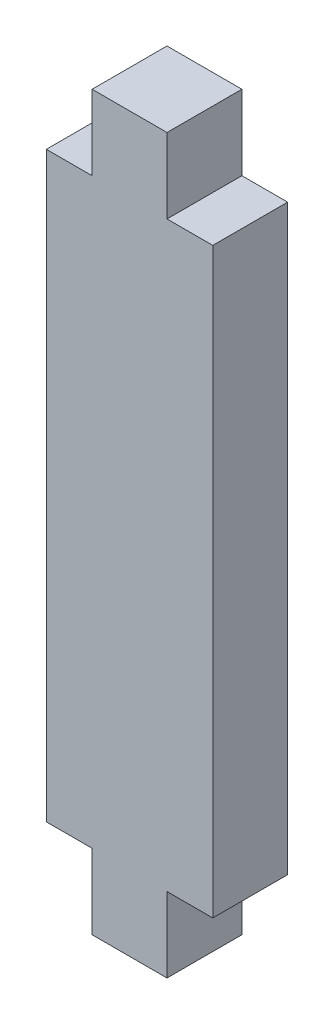
ISO-10303-21;
HEADER;
FILE_DESCRIPTION(('STEP AP214'),'2;1');
FILE_NAME('part.step','',(''),(''),'','','');
FILE_SCHEMA(('AUTOMOTIVE_DESIGN { 1 0 10303 214 1 1 1 1 }'));
ENDSEC;
DATA;
#1=APPLICATION_CONTEXT('core data for automotive mechanical design processes');
#2=APPLICATION_PROTOCOL_DEFINITION('international standard','automotive_design',2000,#1);
#3=PRODUCT_CONTEXT('',#1,'mechanical');
#4=PRODUCT('Part','Part','',(#3));
#5=PRODUCT_RELATED_PRODUCT_CATEGORY('part','',(#4));
#6=PRODUCT_DEFINITION_FORMATION('','',#4);
#7=PRODUCT_DEFINITION_CONTEXT('part definition',#1,'design');
#8=PRODUCT_DEFINITION('design','',#6,#7);
#9=PRODUCT_DEFINITION_SHAPE('','',#8);
#10=(LENGTH_UNIT() NAMED_UNIT(*) SI_UNIT(.MILLI.,.METRE.));
#11=(NAMED_UNIT(*) PLANE_ANGLE_UNIT() SI_UNIT($,.RADIAN.));
#12=(NAMED_UNIT(*) SI_UNIT($,.STERADIAN.) SOLID_ANGLE_UNIT());
#13=UNCERTAINTY_MEASURE_WITH_UNIT(LENGTH_MEASURE(1.E-05),#10,'distance_accuracy_value','');
#14=(GEOMETRIC_REPRESENTATION_CONTEXT(3) GLOBAL_UNCERTAINTY_ASSIGNED_CONTEXT((#13)) GLOBAL_UNIT_ASSIGNED_CONTEXT((#10,
#11,#12)) REPRESENTATION_CONTEXT('',''));
#15=CARTESIAN_POINT('',(0.,0.,0.));
#16=DIRECTION('',(0.,0.,1.));
#17=DIRECTION('',(1.,0.,0.));
#18=AXIS2_PLACEMENT_3D('',#15,#16,#17);
#19=CARTESIAN_POINT('',(2.25,0.,-2.25));
#20=DIRECTION('',(-1.,0.,0.));
#21=DIRECTION('',(0.,0.,1.));
#22=AXIS2_PLACEMENT_3D('',#19,#20,#21);
#23=PLANE('',#22);
#24=DIRECTION('',(0.,-1.,0.));
#25=VECTOR('',#24,1.);
#26=CARTESIAN_POINT('',(2.25,0.,2.25));
#27=LINE('',#26,#25);
#28=CARTESIAN_POINT('',(2.25,22.,2.25));
#29=VERTEX_POINT('',#28);
#30=CARTESIAN_POINT('',(2.25,17.5,2.25));
#31=VERTEX_POINT('',#30);
#32=EDGE_CURVE('E131',#29,#31,#27,.T.);
#33=ORIENTED_EDGE('',*,*,#32,.T.);
#34=DIRECTION('',(0.,0.,1.));
#35=VECTOR('',#34,1.);
#36=CARTESIAN_POINT('',(2.25,17.5,-2.25));
#37=LINE('',#36,#35);
#38=CARTESIAN_POINT('',(2.25,17.5,-2.25));
#39=VERTEX_POINT('',#38);
#40=EDGE_CURVE('E11',#39,#31,#37,.T.);
#41=ORIENTED_EDGE('',*,*,#40,.F.);
#42=DIRECTION('',(0.,-1.,0.));
#43=VECTOR('',#42,1.);
#44=CARTESIAN_POINT('',(2.25,0.,-2.25));
#45=LINE('',#44,#43);
#46=CARTESIAN_POINT('',(2.25,22.,-2.25));
#47=VERTEX_POINT('',#46);
#48=EDGE_CURVE('E157',#47,#39,#45,.T.);
#49=ORIENTED_EDGE('',*,*,#48,.F.);
#50=DIRECTION('',(0.,0.,1.));
#51=VECTOR('',#50,1.);
#52=CARTESIAN_POINT('',(2.25,22.,-2.25));
#53=LINE('',#52,#51);
#54=EDGE_CURVE('E38',#47,#29,#53,.T.);
#55=ORIENTED_EDGE('',*,*,#54,.T.);
#56=EDGE_LOOP('',(#33,#41,#49,#55));
#57=FACE_BOUND('',#56,.T.);
#58=ADVANCED_FACE('F35',(#57),#23,.F.);
#59=CARTESIAN_POINT('',(0.,17.5,-2.25));
#60=DIRECTION('',(0.,-1.,0.));
#61=DIRECTION('',(0.,0.,-1.));
#62=AXIS2_PLACEMENT_3D('',#59,#60,#61);
#63=PLANE('',#62);
#64=DIRECTION('',(1.,0.,0.));
#65=VECTOR('',#64,1.);
#66=CARTESIAN_POINT('',(0.,17.5,2.25));
#67=LINE('',#66,#65);
#68=CARTESIAN_POINT('',(5.,17.5,2.25));
#69=VERTEX_POINT('',#68);
#70=EDGE_CURVE('E73',#31,#69,#67,.T.);
#71=ORIENTED_EDGE('',*,*,#70,.T.);
#72=DIRECTION('',(0.,0.,1.));
#73=VECTOR('',#72,1.);
#74=CARTESIAN_POINT('',(5.,17.5,-2.25));
#75=LINE('',#74,#73);
#76=CARTESIAN_POINT('',(5.,17.5,-2.25));
#77=VERTEX_POINT('',#76);
#78=EDGE_CURVE('E44',#77,#69,#75,.T.);
#79=ORIENTED_EDGE('',*,*,#78,.F.);
#80=DIRECTION('',(1.,0.,0.));
#81=VECTOR('',#80,1.);
#82=CARTESIAN_POINT('',(0.,17.5,-2.25));
#83=LINE('',#82,#81);
#84=EDGE_CURVE('E52',#39,#77,#83,.T.);
#85=ORIENTED_EDGE('',*,*,#84,.F.);
#86=ORIENTED_EDGE('',*,*,#40,.T.);
#87=EDGE_LOOP('',(#71,#79,#85,#86));
#88=FACE_BOUND('',#87,.T.);
#89=ADVANCED_FACE('F159',(#88),#63,.F.);
#90=CARTESIAN_POINT('',(5.,0.,-2.25));
#91=DIRECTION('',(-1.,0.,0.));
#92=DIRECTION('',(0.,-1.,0.));
#93=AXIS2_PLACEMENT_3D('',#90,#91,#92);
#94=PLANE('',#93);
#95=DIRECTION('',(0.,-1.,0.));
#96=VECTOR('',#95,1.);
#97=CARTESIAN_POINT('',(5.,0.,2.25));
#98=LINE('',#97,#96);
#99=CARTESIAN_POINT('',(5.,-17.5,2.25));
#100=VERTEX_POINT('',#99);
#101=EDGE_CURVE('E143',#69,#100,#98,.T.);
#102=ORIENTED_EDGE('',*,*,#101,.T.);
#103=DIRECTION('',(0.,0.,1.));
#104=VECTOR('',#103,1.);
#105=CARTESIAN_POINT('',(5.,-17.5,-2.25));
#106=LINE('',#105,#104);
#107=CARTESIAN_POINT('',(5.,-17.5,-2.25));
#108=VERTEX_POINT('',#107);
#109=EDGE_CURVE('E163',#108,#100,#106,.T.);
#110=ORIENTED_EDGE('',*,*,#109,.F.);
#111=DIRECTION('',(0.,-1.,0.));
#112=VECTOR('',#111,1.);
#113=CARTESIAN_POINT('',(5.,0.,-2.25));
#114=LINE('',#113,#112);
#115=EDGE_CURVE('E125',#77,#108,#114,.T.);
#116=ORIENTED_EDGE('',*,*,#115,.F.);
#117=ORIENTED_EDGE('',*,*,#78,.T.);
#118=EDGE_LOOP('',(#102,#110,#116,#117));
#119=FACE_BOUND('',#118,.T.);
#120=ADVANCED_FACE('F161',(#119),#94,.F.);
#121=CARTESIAN_POINT('',(-5.,0.,-2.25));
#122=DIRECTION('',(-1.,0.,0.));
#123=DIRECTION('',(0.,-1.,0.));
#124=AXIS2_PLACEMENT_3D('',#121,#122,#123);
#125=PLANE('',#124);
#126=DIRECTION('',(0.,-1.,0.));
#127=VECTOR('',#126,1.);
#128=CARTESIAN_POINT('',(-5.,0.,2.25));
#129=LINE('',#128,#127);
#130=CARTESIAN_POINT('',(-5.,17.5,2.25));
#131=VERTEX_POINT('',#130);
#132=CARTESIAN_POINT('',(-5.,-17.5,2.25));
#133=VERTEX_POINT('',#132);
#134=EDGE_CURVE('E108',#131,#133,#129,.T.);
#135=ORIENTED_EDGE('',*,*,#134,.F.);
#136=DIRECTION('',(0.,0.,1.));
#137=VECTOR('',#136,1.);
#138=CARTESIAN_POINT('',(-5.,17.5,-2.25));
#139=LINE('',#138,#137);
#140=CARTESIAN_POINT('',(-5.,17.5,-2.25));
#141=VERTEX_POINT('',#140);
#142=EDGE_CURVE('E99',#141,#131,#139,.T.);
#143=ORIENTED_EDGE('',*,*,#142,.F.);
#144=DIRECTION('',(0.,-1.,0.));
#145=VECTOR('',#144,1.);
#146=CARTESIAN_POINT('',(-5.,0.,-2.25));
#147=LINE('',#146,#145);
#148=CARTESIAN_POINT('',(-5.,-17.5,-2.25));
#149=VERTEX_POINT('',#148);
#150=EDGE_CURVE('E105',#141,#149,#147,.T.);
#151=ORIENTED_EDGE('',*,*,#150,.T.);
#152=DIRECTION('',(0.,0.,1.));
#153=VECTOR('',#152,1.);
#154=CARTESIAN_POINT('',(-5.,-17.5,-2.25));
#155=LINE('',#154,#153);
#156=EDGE_CURVE('E170',#149,#133,#155,.T.);
#157=ORIENTED_EDGE('',*,*,#156,.T.);
#158=EDGE_LOOP('',(#135,#143,#151,#157));
#159=FACE_BOUND('',#158,.T.);
#160=ADVANCED_FACE('F101',(#159),#125,.T.);
#161=CARTESIAN_POINT('',(-2.25,17.5,2.25));
#162=VERTEX_POINT('',#161);
#163=EDGE_CURVE('E140',#131,#162,#67,.T.);
#164=ORIENTED_EDGE('',*,*,#163,.T.);
#165=DIRECTION('',(0.,0.,1.));
#166=VECTOR('',#165,1.);
#167=CARTESIAN_POINT('',(-2.25,17.5,-2.25));
#168=LINE('',#167,#166);
#169=CARTESIAN_POINT('',(-2.25,17.5,-2.25));
#170=VERTEX_POINT('',#169);
#171=EDGE_CURVE('E112',#170,#162,#168,.T.);
#172=ORIENTED_EDGE('',*,*,#171,.F.);
#173=EDGE_CURVE('E115',#141,#170,#83,.T.);
#174=ORIENTED_EDGE('',*,*,#173,.F.);
#175=ORIENTED_EDGE('',*,*,#142,.T.);
#176=EDGE_LOOP('',(#164,#172,#174,#175));
#177=FACE_BOUND('',#176,.T.);
#178=ADVANCED_FACE('F116',(#177),#63,.F.);
#179=CARTESIAN_POINT('',(-2.25,0.,-2.25));
#180=DIRECTION('',(-1.,0.,0.));
#181=DIRECTION('',(0.,-1.,0.));
#182=AXIS2_PLACEMENT_3D('',#179,#180,#181);
#183=PLANE('',#182);
#184=DIRECTION('',(0.,-1.,0.));
#185=VECTOR('',#184,1.);
#186=CARTESIAN_POINT('',(-2.25,0.,2.25));
#187=LINE('',#186,#185);
#188=CARTESIAN_POINT('',(-2.25,22.,2.25));
#189=VERTEX_POINT('',#188);
#190=EDGE_CURVE('E137',#189,#162,#187,.T.);
#191=ORIENTED_EDGE('',*,*,#190,.F.);
#192=DIRECTION('',(0.,0.,1.));
#193=VECTOR('',#192,1.);
#194=CARTESIAN_POINT('',(-2.25,22.,-2.25));
#195=LINE('',#194,#193);
#196=CARTESIAN_POINT('',(-2.25,22.,-2.25));
#197=VERTEX_POINT('',#196);
#198=EDGE_CURVE('E147',#197,#189,#195,.T.);
#199=ORIENTED_EDGE('',*,*,#198,.F.);
#200=DIRECTION('',(0.,-1.,0.));
#201=VECTOR('',#200,1.);
#202=CARTESIAN_POINT('',(-2.25,0.,-2.25));
#203=LINE('',#202,#201);
#204=EDGE_CURVE('E118',#197,#170,#203,.T.);
#205=ORIENTED_EDGE('',*,*,#204,.T.);
#206=ORIENTED_EDGE('',*,*,#171,.T.);
#207=EDGE_LOOP('',(#191,#199,#205,#206));
#208=FACE_BOUND('',#207,.T.);
#209=ADVANCED_FACE('F210',(#208),#183,.T.);
#210=CARTESIAN_POINT('',(0.,22.,-2.25));
#211=DIRECTION('',(0.,-1.,0.));
#212=DIRECTION('',(0.,0.,-1.));
#213=AXIS2_PLACEMENT_3D('',#210,#211,#212);
#214=PLANE('',#213);
#215=DIRECTION('',(1.,0.,0.));
#216=VECTOR('',#215,1.);
#217=CARTESIAN_POINT('',(0.,22.,2.25));
#218=LINE('',#217,#216);
#219=EDGE_CURVE('E134',#189,#29,#218,.T.);
#220=ORIENTED_EDGE('',*,*,#219,.T.);
#221=ORIENTED_EDGE('',*,*,#54,.F.);
#222=DIRECTION('',(1.,0.,0.));
#223=VECTOR('',#222,1.);
#224=CARTESIAN_POINT('',(0.,22.,-2.25));
#225=LINE('',#224,#223);
#226=EDGE_CURVE('E85',#197,#47,#225,.T.);
#227=ORIENTED_EDGE('',*,*,#226,.F.);
#228=ORIENTED_EDGE('',*,*,#198,.T.);
#229=EDGE_LOOP('',(#220,#221,#227,#228));
#230=FACE_BOUND('',#229,.T.);
#231=ADVANCED_FACE('F211',(#230),#214,.F.);
#232=CARTESIAN_POINT('',(0.,0.,-2.25));
#233=DIRECTION('',(0.,0.,1.));
#234=DIRECTION('',(1.,0.,0.));
#235=AXIS2_PLACEMENT_3D('',#232,#233,#234);
#236=PLANE('',#235);
#237=ORIENTED_EDGE('',*,*,#48,.T.);
#238=ORIENTED_EDGE('',*,*,#84,.T.);
#239=ORIENTED_EDGE('',*,*,#115,.T.);
#240=DIRECTION('',(1.,0.,0.));
#241=VECTOR('',#240,1.);
#242=CARTESIAN_POINT('',(0.,-17.5,-2.25));
#243=LINE('',#242,#241);
#244=CARTESIAN_POINT('',(2.25,-17.5,-2.25));
#245=VERTEX_POINT('',#244);
#246=EDGE_CURVE('E173',#245,#108,#243,.T.);
#247=ORIENTED_EDGE('',*,*,#246,.F.);
#248=DIRECTION('',(0.,1.,0.));
#249=VECTOR('',#248,1.);
#250=CARTESIAN_POINT('',(2.25,0.,-2.25));
#251=LINE('',#250,#249);
#252=CARTESIAN_POINT('',(2.25,-22.,-2.25));
#253=VERTEX_POINT('',#252);
#254=EDGE_CURVE('E246',#253,#245,#251,.T.);
#255=ORIENTED_EDGE('',*,*,#254,.F.);
#256=DIRECTION('',(1.,0.,0.));
#257=VECTOR('',#256,1.);
#258=CARTESIAN_POINT('',(0.,-22.,-2.25));
#259=LINE('',#258,#257);
#260=CARTESIAN_POINT('',(-2.25,-22.,-2.25));
#261=VERTEX_POINT('',#260);
#262=EDGE_CURVE('E242',#261,#253,#259,.T.);
#263=ORIENTED_EDGE('',*,*,#262,.F.);
#264=DIRECTION('',(0.,1.,0.));
#265=VECTOR('',#264,1.);
#266=CARTESIAN_POINT('',(-2.25,0.,-2.25));
#267=LINE('',#266,#265);
#268=CARTESIAN_POINT('',(-2.25,-17.5,-2.25));
#269=VERTEX_POINT('',#268);
#270=EDGE_CURVE('E183',#261,#269,#267,.T.);
#271=ORIENTED_EDGE('',*,*,#270,.T.);
#272=EDGE_CURVE('E123',#149,#269,#243,.T.);
#273=ORIENTED_EDGE('',*,*,#272,.F.);
#274=ORIENTED_EDGE('',*,*,#150,.F.);
#275=ORIENTED_EDGE('',*,*,#173,.T.);
#276=ORIENTED_EDGE('',*,*,#204,.F.);
#277=ORIENTED_EDGE('',*,*,#226,.T.);
#278=EDGE_LOOP('',(#237,#238,#239,#247,#255,#263,#271,#273,#274,#275,#276,#277));
#279=FACE_BOUND('',#278,.T.);
#280=ADVANCED_FACE('F120',(#279),#236,.F.);
#281=CARTESIAN_POINT('',(0.,0.,2.25));
#282=DIRECTION('',(0.,0.,1.));
#283=DIRECTION('',(1.,0.,0.));
#284=AXIS2_PLACEMENT_3D('',#281,#282,#283);
#285=PLANE('',#284);
#286=ORIENTED_EDGE('',*,*,#32,.F.);
#287=ORIENTED_EDGE('',*,*,#219,.F.);
#288=ORIENTED_EDGE('',*,*,#190,.T.);
#289=ORIENTED_EDGE('',*,*,#163,.F.);
#290=ORIENTED_EDGE('',*,*,#134,.T.);
#291=DIRECTION('',(1.,0.,0.));
#292=VECTOR('',#291,1.);
#293=CARTESIAN_POINT('',(0.,-17.5,2.25));
#294=LINE('',#293,#292);
#295=CARTESIAN_POINT('',(-2.25,-17.5,2.25));
#296=VERTEX_POINT('',#295);
#297=EDGE_CURVE('E196',#133,#296,#294,.T.);
#298=ORIENTED_EDGE('',*,*,#297,.T.);
#299=DIRECTION('',(0.,1.,0.));
#300=VECTOR('',#299,1.);
#301=CARTESIAN_POINT('',(-2.25,0.,2.25));
#302=LINE('',#301,#300);
#303=CARTESIAN_POINT('',(-2.25,-22.,2.25));
#304=VERTEX_POINT('',#303);
#305=EDGE_CURVE('E193',#304,#296,#302,.T.);
#306=ORIENTED_EDGE('',*,*,#305,.F.);
#307=DIRECTION('',(1.,0.,0.));
#308=VECTOR('',#307,1.);
#309=CARTESIAN_POINT('',(0.,-22.,2.25));
#310=LINE('',#309,#308);
#311=CARTESIAN_POINT('',(2.25,-22.,2.25));
#312=VERTEX_POINT('',#311);
#313=EDGE_CURVE('E190',#304,#312,#310,.T.);
#314=ORIENTED_EDGE('',*,*,#313,.T.);
#315=DIRECTION('',(0.,1.,0.));
#316=VECTOR('',#315,1.);
#317=CARTESIAN_POINT('',(2.25,0.,2.25));
#318=LINE('',#317,#316);
#319=CARTESIAN_POINT('',(2.25,-17.5,2.25));
#320=VERTEX_POINT('',#319);
#321=EDGE_CURVE('E187',#312,#320,#318,.T.);
#322=ORIENTED_EDGE('',*,*,#321,.T.);
#323=EDGE_CURVE('E199',#320,#100,#294,.T.);
#324=ORIENTED_EDGE('',*,*,#323,.T.);
#325=ORIENTED_EDGE('',*,*,#101,.F.);
#326=ORIENTED_EDGE('',*,*,#70,.F.);
#327=EDGE_LOOP('',(#286,#287,#288,#289,#290,#298,#306,#314,#322,#324,#325,#326));
#328=FACE_BOUND('',#327,.T.);
#329=ADVANCED_FACE('F212',(#328),#285,.T.);
#330=CARTESIAN_POINT('',(2.25,0.,-2.25));
#331=DIRECTION('',(-1.,0.,0.));
#332=DIRECTION('',(0.,0.,1.));
#333=AXIS2_PLACEMENT_3D('',#330,#331,#332);
#334=PLANE('',#333);
#335=ORIENTED_EDGE('',*,*,#321,.F.);
#336=DIRECTION('',(0.,0.,1.));
#337=VECTOR('',#336,1.);
#338=CARTESIAN_POINT('',(2.25,-22.,-2.25));
#339=LINE('',#338,#337);
#340=EDGE_CURVE('E178',#253,#312,#339,.T.);
#341=ORIENTED_EDGE('',*,*,#340,.F.);
#342=ORIENTED_EDGE('',*,*,#254,.T.);
#343=DIRECTION('',(0.,0.,1.));
#344=VECTOR('',#343,1.);
#345=CARTESIAN_POINT('',(2.25,-17.5,-2.25));
#346=LINE('',#345,#344);
#347=EDGE_CURVE('E135',#245,#320,#346,.T.);
#348=ORIENTED_EDGE('',*,*,#347,.T.);
#349=EDGE_LOOP('',(#335,#341,#342,#348));
#350=FACE_BOUND('',#349,.T.);
#351=ADVANCED_FACE('F249',(#350),#334,.F.);
#352=CARTESIAN_POINT('',(0.,-17.5,-2.25));
#353=DIRECTION('',(0.,1.,0.));
#354=DIRECTION('',(0.,0.,-1.));
#355=AXIS2_PLACEMENT_3D('',#352,#353,#354);
#356=PLANE('',#355);
#357=ORIENTED_EDGE('',*,*,#323,.F.);
#358=ORIENTED_EDGE('',*,*,#347,.F.);
#359=ORIENTED_EDGE('',*,*,#246,.T.);
#360=ORIENTED_EDGE('',*,*,#109,.T.);
#361=EDGE_LOOP('',(#357,#358,#359,#360));
#362=FACE_BOUND('',#361,.T.);
#363=ADVANCED_FACE('F174',(#362),#356,.F.);
#364=ORIENTED_EDGE('',*,*,#297,.F.);
#365=ORIENTED_EDGE('',*,*,#156,.F.);
#366=ORIENTED_EDGE('',*,*,#272,.T.);
#367=DIRECTION('',(0.,0.,1.));
#368=VECTOR('',#367,1.);
#369=CARTESIAN_POINT('',(-2.25,-17.5,-2.25));
#370=LINE('',#369,#368);
#371=EDGE_CURVE('E202',#269,#296,#370,.T.);
#372=ORIENTED_EDGE('',*,*,#371,.T.);
#373=EDGE_LOOP('',(#364,#365,#366,#372));
#374=FACE_BOUND('',#373,.T.);
#375=ADVANCED_FACE('F219',(#374),#356,.F.);
#376=CARTESIAN_POINT('',(-2.25,0.,-2.25));
#377=DIRECTION('',(-1.,0.,0.));
#378=DIRECTION('',(0.,1.,0.));
#379=AXIS2_PLACEMENT_3D('',#376,#377,#378);
#380=PLANE('',#379);
#381=ORIENTED_EDGE('',*,*,#305,.T.);
#382=ORIENTED_EDGE('',*,*,#371,.F.);
#383=ORIENTED_EDGE('',*,*,#270,.F.);
#384=DIRECTION('',(0.,0.,1.));
#385=VECTOR('',#384,1.);
#386=CARTESIAN_POINT('',(-2.25,-22.,-2.25));
#387=LINE('',#386,#385);
#388=EDGE_CURVE('E181',#261,#304,#387,.T.);
#389=ORIENTED_EDGE('',*,*,#388,.T.);
#390=EDGE_LOOP('',(#381,#382,#383,#389));
#391=FACE_BOUND('',#390,.T.);
#392=ADVANCED_FACE('F226',(#391),#380,.T.);
#393=CARTESIAN_POINT('',(0.,-22.,-2.25));
#394=DIRECTION('',(0.,1.,0.));
#395=DIRECTION('',(0.,0.,-1.));
#396=AXIS2_PLACEMENT_3D('',#393,#394,#395);
#397=PLANE('',#396);
#398=ORIENTED_EDGE('',*,*,#313,.F.);
#399=ORIENTED_EDGE('',*,*,#388,.F.);
#400=ORIENTED_EDGE('',*,*,#262,.T.);
#401=ORIENTED_EDGE('',*,*,#340,.T.);
#402=EDGE_LOOP('',(#398,#399,#400,#401));
#403=FACE_BOUND('',#402,.T.);
#404=ADVANCED_FACE('F243',(#403),#397,.F.);
#405=CLOSED_SHELL('',(#58,#89,#120,#160,#178,#209,#231,#280,#329,#351,#363,#375,#392,#404));
#406=MANIFOLD_SOLID_BREP('B2',#405);
#407=ADVANCED_BREP_SHAPE_REPRESENTATION('',(#18,#406),#14);
#408=SHAPE_DEFINITION_REPRESENTATION(#9,#407);
ENDSEC;
END-ISO-10303-21;
